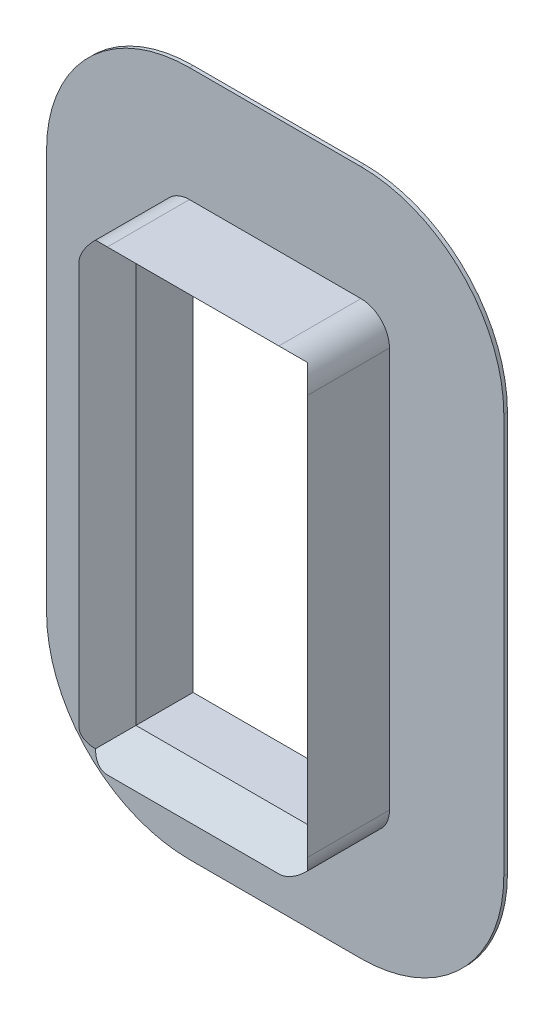
ISO-10303-21;
HEADER;
FILE_DESCRIPTION(('STEP AP214'),'2;1');
FILE_NAME('part.step','',(''),(''),'','','');
FILE_SCHEMA(('AUTOMOTIVE_DESIGN { 1 0 10303 214 1 1 1 1 }'));
ENDSEC;
DATA;
#1=APPLICATION_CONTEXT('core data for automotive mechanical design processes');
#2=APPLICATION_PROTOCOL_DEFINITION('international standard','automotive_design',2000,#1);
#3=PRODUCT_CONTEXT('',#1,'mechanical');
#4=PRODUCT('Part','Part','',(#3));
#5=PRODUCT_RELATED_PRODUCT_CATEGORY('part','',(#4));
#6=PRODUCT_DEFINITION_FORMATION('','',#4);
#7=PRODUCT_DEFINITION_CONTEXT('part definition',#1,'design');
#8=PRODUCT_DEFINITION('design','',#6,#7);
#9=PRODUCT_DEFINITION_SHAPE('','',#8);
#10=(LENGTH_UNIT() NAMED_UNIT(*) SI_UNIT(.MILLI.,.METRE.));
#11=(NAMED_UNIT(*) PLANE_ANGLE_UNIT() SI_UNIT($,.RADIAN.));
#12=(NAMED_UNIT(*) SI_UNIT($,.STERADIAN.) SOLID_ANGLE_UNIT());
#13=UNCERTAINTY_MEASURE_WITH_UNIT(LENGTH_MEASURE(1.E-05),#10,'distance_accuracy_value','');
#14=(GEOMETRIC_REPRESENTATION_CONTEXT(3) GLOBAL_UNCERTAINTY_ASSIGNED_CONTEXT((#13)) GLOBAL_UNIT_ASSIGNED_CONTEXT((#10,
#11,#12)) REPRESENTATION_CONTEXT('',''));
#15=CARTESIAN_POINT('',(0.,0.,0.));
#16=DIRECTION('',(0.,0.,1.));
#17=DIRECTION('',(1.,0.,0.));
#18=AXIS2_PLACEMENT_3D('',#15,#16,#17);
#19=CARTESIAN_POINT('',(0.,146.05,9.525));
#20=DIRECTION('',(0.,1.,0.));
#21=DIRECTION('',(0.,0.,1.));
#22=AXIS2_PLACEMENT_3D('',#19,#20,#21);
#23=PLANE('',#22);
#24=DIRECTION('',(1.,0.,0.));
#25=VECTOR('',#24,1.);
#26=CARTESIAN_POINT('',(0.,146.05,0.));
#27=LINE('',#26,#25);
#28=CARTESIAN_POINT('',(-9.52499999999998,146.05,0.));
#29=VERTEX_POINT('',#28);
#30=CARTESIAN_POINT('',(9.52499999999997,146.05,0.));
#31=VERTEX_POINT('',#30);
#32=EDGE_CURVE('E176',#29,#31,#27,.T.);
#33=ORIENTED_EDGE('',*,*,#32,.F.);
#34=DIRECTION('',(0.,0.,-1.));
#35=VECTOR('',#34,1.);
#36=CARTESIAN_POINT('',(-9.52499999999998,146.05,9.525));
#37=LINE('',#36,#35);
#38=CARTESIAN_POINT('',(-9.52499999999998,146.05,9.525));
#39=VERTEX_POINT('',#38);
#40=EDGE_CURVE('E161',#39,#29,#37,.T.);
#41=ORIENTED_EDGE('',*,*,#40,.F.);
#42=DIRECTION('',(1.,0.,0.));
#43=VECTOR('',#42,1.);
#44=CARTESIAN_POINT('',(0.,146.05,9.525));
#45=LINE('',#44,#43);
#46=CARTESIAN_POINT('',(9.52499999999997,146.05,9.525));
#47=VERTEX_POINT('',#46);
#48=EDGE_CURVE('E173',#39,#47,#45,.T.);
#49=ORIENTED_EDGE('',*,*,#48,.T.);
#50=DIRECTION('',(0.,0.,-1.));
#51=VECTOR('',#50,1.);
#52=CARTESIAN_POINT('',(9.52499999999997,146.05,9.525));
#53=LINE('',#52,#51);
#54=EDGE_CURVE('E244',#47,#31,#53,.T.);
#55=ORIENTED_EDGE('',*,*,#54,.T.);
#56=EDGE_LOOP('',(#33,#41,#49,#55));
#57=FACE_BOUND('',#56,.T.);
#58=ADVANCED_FACE('F56',(#57),#23,.T.);
#59=CARTESIAN_POINT('',(-9.52500000000001,142.875,9.525));
#60=DIRECTION('',(0.,0.,-1.));
#61=DIRECTION('',(-1.,0.,0.));
#62=AXIS2_PLACEMENT_3D('',#59,#60,#61);
#63=CYLINDRICAL_SURFACE('',#62,3.17500000000001);
#64=DIRECTION('',(0.,0.,-1.));
#65=VECTOR('',#64,1.);
#66=CARTESIAN_POINT('',(-12.7,142.875,9.525));
#67=LINE('',#66,#65);
#68=CARTESIAN_POINT('',(-12.7,142.875,9.525));
#69=VERTEX_POINT('',#68);
#70=CARTESIAN_POINT('',(-12.7,142.875,0.));
#71=VERTEX_POINT('',#70);
#72=EDGE_CURVE('E179',#69,#71,#67,.T.);
#73=ORIENTED_EDGE('',*,*,#72,.F.);
#74=CARTESIAN_POINT('',(-9.52500000000001,142.875,6.35));
#75=DIRECTION('',(-0.707106781186546,0.,-0.707106781186549));
#76=DIRECTION('',(0.707106781186549,0.,-0.707106781186546));
#77=AXIS2_PLACEMENT_3D('',#74,#75,#76);
#78=ELLIPSE('',#77,4.49012806053458,3.17500000000001);
#79=CARTESIAN_POINT('',(-11.7700640302673,145.120064030267,8.59506403026728));
#80=VERTEX_POINT('',#79);
#81=EDGE_CURVE('E67',#69,#80,#78,.T.);
#82=ORIENTED_EDGE('',*,*,#81,.T.);
#83=CARTESIAN_POINT('',(-9.52500000000001,142.875,6.35));
#84=DIRECTION('',(0.,-0.707106781186546,0.707106781186549));
#85=DIRECTION('',(0.,-0.707106781186549,-0.707106781186546));
#86=AXIS2_PLACEMENT_3D('',#83,#84,#85);
#87=ELLIPSE('',#86,4.49012806053458,3.17500000000001);
#88=EDGE_CURVE('E157',#80,#39,#87,.F.);
#89=ORIENTED_EDGE('',*,*,#88,.T.);
#90=ORIENTED_EDGE('',*,*,#40,.T.);
#91=CARTESIAN_POINT('',(-9.52500000000001,142.875,0.));
#92=DIRECTION('',(0.,0.,1.));
#93=DIRECTION('',(1.,0.,0.));
#94=AXIS2_PLACEMENT_3D('',#91,#92,#93);
#95=CIRCLE('',#94,3.17500000000001);
#96=EDGE_CURVE('E222',#29,#71,#95,.T.);
#97=ORIENTED_EDGE('',*,*,#96,.T.);
#98=EDGE_LOOP('',(#73,#82,#89,#90,#97));
#99=FACE_BOUND('',#98,.T.);
#100=ADVANCED_FACE('F159',(#99),#63,.T.);
#101=CARTESIAN_POINT('',(-12.7,0.,9.525));
#102=DIRECTION('',(1.,0.,0.));
#103=DIRECTION('',(0.,1.,0.));
#104=AXIS2_PLACEMENT_3D('',#101,#102,#103);
#105=PLANE('',#104);
#106=DIRECTION('',(0.,-1.,0.));
#107=VECTOR('',#106,1.);
#108=CARTESIAN_POINT('',(-12.7,0.,0.));
#109=LINE('',#108,#107);
#110=CARTESIAN_POINT('',(-12.7,98.425,0.));
#111=VERTEX_POINT('',#110);
#112=EDGE_CURVE('E225',#71,#111,#109,.T.);
#113=ORIENTED_EDGE('',*,*,#112,.T.);
#114=DIRECTION('',(0.,0.,-1.));
#115=VECTOR('',#114,1.);
#116=CARTESIAN_POINT('',(-12.7,98.425,9.525));
#117=LINE('',#116,#115);
#118=CARTESIAN_POINT('',(-12.7,98.425,9.525));
#119=VERTEX_POINT('',#118);
#120=EDGE_CURVE('E262',#119,#111,#117,.T.);
#121=ORIENTED_EDGE('',*,*,#120,.F.);
#122=DIRECTION('',(0.,-1.,0.));
#123=VECTOR('',#122,1.);
#124=CARTESIAN_POINT('',(-12.7,0.,9.525));
#125=LINE('',#124,#123);
#126=EDGE_CURVE('E184',#69,#119,#125,.T.);
#127=ORIENTED_EDGE('',*,*,#126,.F.);
#128=ORIENTED_EDGE('',*,*,#72,.T.);
#129=EDGE_LOOP('',(#113,#121,#127,#128));
#130=FACE_BOUND('',#129,.T.);
#131=ADVANCED_FACE('F336',(#130),#105,.F.);
#132=CARTESIAN_POINT('',(-9.525,98.425,9.525));
#133=DIRECTION('',(0.,0.,-1.));
#134=DIRECTION('',(-1.,0.,0.));
#135=AXIS2_PLACEMENT_3D('',#132,#133,#134);
#136=CYLINDRICAL_SURFACE('',#135,3.175);
#137=DIRECTION('',(0.,0.,-1.));
#138=VECTOR('',#137,1.);
#139=CARTESIAN_POINT('',(-9.52499999999998,95.25,9.525));
#140=LINE('',#139,#138);
#141=CARTESIAN_POINT('',(-9.52499999999998,95.25,9.525));
#142=VERTEX_POINT('',#141);
#143=CARTESIAN_POINT('',(-9.52499999999998,95.25,0.));
#144=VERTEX_POINT('',#143);
#145=EDGE_CURVE('E258',#142,#144,#140,.T.);
#146=ORIENTED_EDGE('',*,*,#145,.F.);
#147=CARTESIAN_POINT('',(-9.525,98.425,6.35000000000003));
#148=DIRECTION('',(0.,-0.707106781186546,-0.707106781186549));
#149=DIRECTION('',(0.,0.707106781186549,-0.707106781186546));
#150=AXIS2_PLACEMENT_3D('',#147,#148,#149);
#151=ELLIPSE('',#150,4.49012806053456,3.175);
#152=CARTESIAN_POINT('',(-11.7700640302673,96.1799359697327,8.5950640302673));
#153=VERTEX_POINT('',#152);
#154=EDGE_CURVE('E291',#142,#153,#151,.T.);
#155=ORIENTED_EDGE('',*,*,#154,.T.);
#156=CARTESIAN_POINT('',(-9.525,98.425,6.34999999999999));
#157=DIRECTION('',(-0.707106781186546,0.,-0.707106781186549));
#158=DIRECTION('',(0.707106781186549,0.,-0.707106781186546));
#159=AXIS2_PLACEMENT_3D('',#156,#157,#158);
#160=ELLIPSE('',#159,4.49012806053456,3.175);
#161=EDGE_CURVE('E288',#153,#119,#160,.T.);
#162=ORIENTED_EDGE('',*,*,#161,.T.);
#163=ORIENTED_EDGE('',*,*,#120,.T.);
#164=CARTESIAN_POINT('',(-9.525,98.425,0.));
#165=DIRECTION('',(0.,0.,1.));
#166=DIRECTION('',(1.,0.,0.));
#167=AXIS2_PLACEMENT_3D('',#164,#165,#166);
#168=CIRCLE('',#167,3.175);
#169=EDGE_CURVE('E229',#111,#144,#168,.T.);
#170=ORIENTED_EDGE('',*,*,#169,.T.);
#171=EDGE_LOOP('',(#146,#155,#162,#163,#170));
#172=FACE_BOUND('',#171,.T.);
#173=ADVANCED_FACE('F395',(#172),#136,.T.);
#174=CARTESIAN_POINT('',(0.,95.25,9.525));
#175=DIRECTION('',(0.,1.,0.));
#176=DIRECTION('',(0.,0.,1.));
#177=AXIS2_PLACEMENT_3D('',#174,#175,#176);
#178=PLANE('',#177);
#179=DIRECTION('',(1.,0.,0.));
#180=VECTOR('',#179,1.);
#181=CARTESIAN_POINT('',(0.,95.25,0.));
#182=LINE('',#181,#180);
#183=CARTESIAN_POINT('',(9.52499999999998,95.25,0.));
#184=VERTEX_POINT('',#183);
#185=EDGE_CURVE('E233',#144,#184,#182,.T.);
#186=ORIENTED_EDGE('',*,*,#185,.T.);
#187=DIRECTION('',(0.,0.,-1.));
#188=VECTOR('',#187,1.);
#189=CARTESIAN_POINT('',(9.52499999999998,95.25,9.525));
#190=LINE('',#189,#188);
#191=CARTESIAN_POINT('',(9.52499999999998,95.25,9.525));
#192=VERTEX_POINT('',#191);
#193=EDGE_CURVE('E254',#192,#184,#190,.T.);
#194=ORIENTED_EDGE('',*,*,#193,.F.);
#195=DIRECTION('',(1.,0.,0.));
#196=VECTOR('',#195,1.);
#197=CARTESIAN_POINT('',(0.,95.25,9.525));
#198=LINE('',#197,#196);
#199=EDGE_CURVE('E190',#142,#192,#198,.T.);
#200=ORIENTED_EDGE('',*,*,#199,.F.);
#201=ORIENTED_EDGE('',*,*,#145,.T.);
#202=EDGE_LOOP('',(#186,#194,#200,#201));
#203=FACE_BOUND('',#202,.T.);
#204=ADVANCED_FACE('F391',(#203),#178,.F.);
#205=CARTESIAN_POINT('',(9.52500000000001,98.425,9.525));
#206=DIRECTION('',(0.,0.,-1.));
#207=DIRECTION('',(-1.,0.,0.));
#208=AXIS2_PLACEMENT_3D('',#205,#206,#207);
#209=CYLINDRICAL_SURFACE('',#208,3.175);
#210=CARTESIAN_POINT('',(9.52500000000001,98.425,6.35000000000003));
#211=DIRECTION('',(-0.707106781186546,0.,0.707106781186549));
#212=DIRECTION('',(-0.707106781186549,0.,-0.707106781186546));
#213=AXIS2_PLACEMENT_3D('',#210,#211,#212);
#214=ELLIPSE('',#213,4.49012806053457,3.175);
#215=CARTESIAN_POINT('',(12.7,98.425,9.525));
#216=VERTEX_POINT('',#215);
#217=CARTESIAN_POINT('',(11.7700640302673,96.1799359697327,8.59506403026728));
#218=VERTEX_POINT('',#217);
#219=EDGE_CURVE('E282',#216,#218,#214,.F.);
#220=ORIENTED_EDGE('',*,*,#219,.T.);
#221=CARTESIAN_POINT('',(9.52500000000001,98.425,6.35));
#222=DIRECTION('',(0.,-0.707106781186546,-0.707106781186549));
#223=DIRECTION('',(0.,0.707106781186549,-0.707106781186546));
#224=AXIS2_PLACEMENT_3D('',#221,#222,#223);
#225=ELLIPSE('',#224,4.49012806053457,3.175);
#226=EDGE_CURVE('E285',#218,#192,#225,.T.);
#227=ORIENTED_EDGE('',*,*,#226,.T.);
#228=ORIENTED_EDGE('',*,*,#193,.T.);
#229=CARTESIAN_POINT('',(9.52500000000001,98.425,0.));
#230=DIRECTION('',(0.,0.,1.));
#231=DIRECTION('',(1.,0.,0.));
#232=AXIS2_PLACEMENT_3D('',#229,#230,#231);
#233=CIRCLE('',#232,3.175);
#234=CARTESIAN_POINT('',(12.7,98.425,0.));
#235=VERTEX_POINT('',#234);
#236=EDGE_CURVE('E237',#184,#235,#233,.T.);
#237=ORIENTED_EDGE('',*,*,#236,.T.);
#238=DIRECTION('',(0.,0.,-1.));
#239=VECTOR('',#238,1.);
#240=CARTESIAN_POINT('',(12.7,98.425,9.525));
#241=LINE('',#240,#239);
#242=EDGE_CURVE('E251',#216,#235,#241,.T.);
#243=ORIENTED_EDGE('',*,*,#242,.F.);
#244=EDGE_LOOP('',(#220,#227,#228,#237,#243));
#245=FACE_BOUND('',#244,.T.);
#246=ADVANCED_FACE('F388',(#245),#209,.T.);
#247=CARTESIAN_POINT('',(12.7,0.,9.525));
#248=DIRECTION('',(1.,0.,0.));
#249=DIRECTION('',(0.,1.,0.));
#250=AXIS2_PLACEMENT_3D('',#247,#248,#249);
#251=PLANE('',#250);
#252=DIRECTION('',(0.,-1.,0.));
#253=VECTOR('',#252,1.);
#254=CARTESIAN_POINT('',(12.7,0.,0.));
#255=LINE('',#254,#253);
#256=CARTESIAN_POINT('',(12.7,142.875,0.));
#257=VERTEX_POINT('',#256);
#258=EDGE_CURVE('E193',#257,#235,#255,.T.);
#259=ORIENTED_EDGE('',*,*,#258,.F.);
#260=DIRECTION('',(0.,0.,-1.));
#261=VECTOR('',#260,1.);
#262=CARTESIAN_POINT('',(12.7,142.875,9.525));
#263=LINE('',#262,#261);
#264=CARTESIAN_POINT('',(12.7,142.875,9.525));
#265=VERTEX_POINT('',#264);
#266=EDGE_CURVE('E247',#265,#257,#263,.T.);
#267=ORIENTED_EDGE('',*,*,#266,.F.);
#268=DIRECTION('',(0.,-1.,0.));
#269=VECTOR('',#268,1.);
#270=CARTESIAN_POINT('',(12.7,0.,9.525));
#271=LINE('',#270,#269);
#272=EDGE_CURVE('E199',#265,#216,#271,.T.);
#273=ORIENTED_EDGE('',*,*,#272,.T.);
#274=ORIENTED_EDGE('',*,*,#242,.T.);
#275=EDGE_LOOP('',(#259,#267,#273,#274));
#276=FACE_BOUND('',#275,.T.);
#277=ADVANCED_FACE('F332',(#276),#251,.T.);
#278=CARTESIAN_POINT('',(-9.52500000000001,0.,9.525));
#279=DIRECTION('',(1.,0.,0.));
#280=DIRECTION('',(0.,0.,-1.));
#281=AXIS2_PLACEMENT_3D('',#278,#279,#280);
#282=PLANE('',#281);
#283=DIRECTION('',(0.,0.,-1.));
#284=VECTOR('',#283,1.);
#285=CARTESIAN_POINT('',(-9.52500000000001,142.875,9.525));
#286=LINE('',#285,#284);
#287=CARTESIAN_POINT('',(-9.52500000000001,142.875,6.35));
#288=VERTEX_POINT('',#287);
#289=CARTESIAN_POINT('',(-9.52500000000001,142.875,0.));
#290=VERTEX_POINT('',#289);
#291=EDGE_CURVE('E248',#288,#290,#286,.T.);
#292=ORIENTED_EDGE('',*,*,#291,.F.);
#293=DIRECTION('',(0.,-1.,0.));
#294=VECTOR('',#293,1.);
#295=CARTESIAN_POINT('',(-9.52500000000001,0.,6.35));
#296=LINE('',#295,#294);
#297=CARTESIAN_POINT('',(-9.52500000000001,98.425,6.35));
#298=VERTEX_POINT('',#297);
#299=EDGE_CURVE('E168',#288,#298,#296,.T.);
#300=ORIENTED_EDGE('',*,*,#299,.T.);
#301=DIRECTION('',(0.,0.,-1.));
#302=VECTOR('',#301,1.);
#303=CARTESIAN_POINT('',(-9.52500000000001,98.425,9.525));
#304=LINE('',#303,#302);
#305=CARTESIAN_POINT('',(-9.52500000000001,98.425,0.));
#306=VERTEX_POINT('',#305);
#307=EDGE_CURVE('E203',#298,#306,#304,.T.);
#308=ORIENTED_EDGE('',*,*,#307,.T.);
#309=DIRECTION('',(0.,-1.,0.));
#310=VECTOR('',#309,1.);
#311=CARTESIAN_POINT('',(-9.52500000000001,0.,0.));
#312=LINE('',#311,#310);
#313=EDGE_CURVE('E204',#290,#306,#312,.T.);
#314=ORIENTED_EDGE('',*,*,#313,.F.);
#315=EDGE_LOOP('',(#292,#300,#308,#314));
#316=FACE_BOUND('',#315,.T.);
#317=ADVANCED_FACE('F358',(#316),#282,.T.);
#318=CARTESIAN_POINT('',(0.,142.875,9.525));
#319=DIRECTION('',(0.,1.,0.));
#320=DIRECTION('',(0.,0.,1.));
#321=AXIS2_PLACEMENT_3D('',#318,#319,#320);
#322=PLANE('',#321);
#323=DIRECTION('',(0.,0.,-1.));
#324=VECTOR('',#323,1.);
#325=CARTESIAN_POINT('',(9.525,142.875,9.525));
#326=LINE('',#325,#324);
#327=CARTESIAN_POINT('',(9.525,142.875,6.35));
#328=VERTEX_POINT('',#327);
#329=CARTESIAN_POINT('',(9.525,142.875,0.));
#330=VERTEX_POINT('',#329);
#331=EDGE_CURVE('E274',#328,#330,#326,.T.);
#332=ORIENTED_EDGE('',*,*,#331,.F.);
#333=DIRECTION('',(-1.,0.,0.));
#334=VECTOR('',#333,1.);
#335=CARTESIAN_POINT('',(-9.52500000000001,142.875,6.35));
#336=LINE('',#335,#334);
#337=EDGE_CURVE('E12',#328,#288,#336,.T.);
#338=ORIENTED_EDGE('',*,*,#337,.T.);
#339=ORIENTED_EDGE('',*,*,#291,.T.);
#340=DIRECTION('',(1.,0.,0.));
#341=VECTOR('',#340,1.);
#342=CARTESIAN_POINT('',(0.,142.875,0.));
#343=LINE('',#342,#341);
#344=EDGE_CURVE('E208',#290,#330,#343,.T.);
#345=ORIENTED_EDGE('',*,*,#344,.T.);
#346=EDGE_LOOP('',(#332,#338,#339,#345));
#347=FACE_BOUND('',#346,.T.);
#348=ADVANCED_FACE('F359',(#347),#322,.F.);
#349=CARTESIAN_POINT('',(9.52499999999995,0.,9.525));
#350=DIRECTION('',(1.,0.,0.));
#351=DIRECTION('',(0.,1.,0.));
#352=AXIS2_PLACEMENT_3D('',#349,#350,#351);
#353=PLANE('',#352);
#354=DIRECTION('',(0.,0.,-1.));
#355=VECTOR('',#354,1.);
#356=CARTESIAN_POINT('',(9.52499999999998,98.425,9.525));
#357=LINE('',#356,#355);
#358=CARTESIAN_POINT('',(9.52499999999998,98.425,6.35));
#359=VERTEX_POINT('',#358);
#360=CARTESIAN_POINT('',(9.52499999999998,98.425,0.));
#361=VERTEX_POINT('',#360);
#362=EDGE_CURVE('E271',#359,#361,#357,.T.);
#363=ORIENTED_EDGE('',*,*,#362,.F.);
#364=DIRECTION('',(0.,1.,0.));
#365=VECTOR('',#364,1.);
#366=CARTESIAN_POINT('',(9.525,142.875,6.35));
#367=LINE('',#366,#365);
#368=EDGE_CURVE('E294',#359,#328,#367,.T.);
#369=ORIENTED_EDGE('',*,*,#368,.T.);
#370=ORIENTED_EDGE('',*,*,#331,.T.);
#371=DIRECTION('',(0.,-1.,0.));
#372=VECTOR('',#371,1.);
#373=CARTESIAN_POINT('',(9.52499999999995,0.,0.));
#374=LINE('',#373,#372);
#375=EDGE_CURVE('E212',#330,#361,#374,.T.);
#376=ORIENTED_EDGE('',*,*,#375,.T.);
#377=EDGE_LOOP('',(#363,#369,#370,#376));
#378=FACE_BOUND('',#377,.T.);
#379=ADVANCED_FACE('F352',(#378),#353,.F.);
#380=CARTESIAN_POINT('',(1.43403807347416E-13,98.425,9.525));
#381=DIRECTION('',(0.,1.,0.));
#382=DIRECTION('',(-1.,0.,0.));
#383=AXIS2_PLACEMENT_3D('',#380,#381,#382);
#384=PLANE('',#383);
#385=ORIENTED_EDGE('',*,*,#307,.F.);
#386=DIRECTION('',(1.,0.,0.));
#387=VECTOR('',#386,1.);
#388=CARTESIAN_POINT('',(1.43403807347416E-13,98.425,6.35));
#389=LINE('',#388,#387);
#390=EDGE_CURVE('E178',#298,#359,#389,.T.);
#391=ORIENTED_EDGE('',*,*,#390,.T.);
#392=ORIENTED_EDGE('',*,*,#362,.T.);
#393=DIRECTION('',(1.,0.,0.));
#394=VECTOR('',#393,1.);
#395=CARTESIAN_POINT('',(1.43403807347416E-13,98.425,0.));
#396=LINE('',#395,#394);
#397=EDGE_CURVE('E216',#306,#361,#396,.T.);
#398=ORIENTED_EDGE('',*,*,#397,.F.);
#399=EDGE_LOOP('',(#385,#391,#392,#398));
#400=FACE_BOUND('',#399,.T.);
#401=ADVANCED_FACE('F349',(#400),#384,.T.);
#402=CARTESIAN_POINT('',(9.52499999999999,142.875,9.525));
#403=DIRECTION('',(0.,0.,-1.));
#404=DIRECTION('',(-1.,0.,0.));
#405=AXIS2_PLACEMENT_3D('',#402,#403,#404);
#406=CYLINDRICAL_SURFACE('',#405,3.17500000000001);
#407=CARTESIAN_POINT('',(9.52499999999999,142.875,6.35));
#408=DIRECTION('',(0.,-0.707106781186546,0.707106781186549));
#409=DIRECTION('',(0.,-0.707106781186549,-0.707106781186546));
#410=AXIS2_PLACEMENT_3D('',#407,#408,#409);
#411=ELLIPSE('',#410,4.49012806053458,3.17500000000001);
#412=CARTESIAN_POINT('',(11.7700640302673,145.120064030267,8.59506403026729));
#413=VERTEX_POINT('',#412);
#414=EDGE_CURVE('E182',#47,#413,#411,.F.);
#415=ORIENTED_EDGE('',*,*,#414,.T.);
#416=CARTESIAN_POINT('',(9.52499999999999,142.875,6.35));
#417=DIRECTION('',(-0.707106781186546,0.,0.707106781186549));
#418=DIRECTION('',(-0.707106781186549,0.,-0.707106781186546));
#419=AXIS2_PLACEMENT_3D('',#416,#417,#418);
#420=ELLIPSE('',#419,4.49012806053458,3.17500000000001);
#421=EDGE_CURVE('E299',#413,#265,#420,.F.);
#422=ORIENTED_EDGE('',*,*,#421,.T.);
#423=ORIENTED_EDGE('',*,*,#266,.T.);
#424=CARTESIAN_POINT('',(9.52499999999999,142.875,0.));
#425=DIRECTION('',(0.,0.,1.));
#426=DIRECTION('',(1.,0.,0.));
#427=AXIS2_PLACEMENT_3D('',#424,#425,#426);
#428=CIRCLE('',#427,3.17500000000001);
#429=EDGE_CURVE('E185',#257,#31,#428,.T.);
#430=ORIENTED_EDGE('',*,*,#429,.T.);
#431=ORIENTED_EDGE('',*,*,#54,.F.);
#432=EDGE_LOOP('',(#415,#422,#423,#430,#431));
#433=FACE_BOUND('',#432,.T.);
#434=ADVANCED_FACE('F328',(#433),#406,.T.);
#435=CARTESIAN_POINT('',(0.,0.,0.));
#436=DIRECTION('',(0.,0.,1.));
#437=DIRECTION('',(1.,0.,0.));
#438=AXIS2_PLACEMENT_3D('',#435,#436,#437);
#439=PLANE('',#438);
#440=ORIENTED_EDGE('',*,*,#313,.T.);
#441=ORIENTED_EDGE('',*,*,#397,.T.);
#442=ORIENTED_EDGE('',*,*,#375,.F.);
#443=ORIENTED_EDGE('',*,*,#344,.F.);
#444=EDGE_LOOP('',(#440,#441,#442,#443));
#445=FACE_BOUND('',#444,.T.);
#446=ORIENTED_EDGE('',*,*,#32,.T.);
#447=ORIENTED_EDGE('',*,*,#429,.F.);
#448=ORIENTED_EDGE('',*,*,#258,.T.);
#449=ORIENTED_EDGE('',*,*,#236,.F.);
#450=ORIENTED_EDGE('',*,*,#185,.F.);
#451=ORIENTED_EDGE('',*,*,#169,.F.);
#452=ORIENTED_EDGE('',*,*,#112,.F.);
#453=ORIENTED_EDGE('',*,*,#96,.F.);
#454=EDGE_LOOP('',(#446,#447,#448,#449,#450,#451,#452,#453));
#455=FACE_BOUND('',#454,.T.);
#456=ADVANCED_FACE('F334',(#445,#455),#439,.F.);
#457=CARTESIAN_POINT('',(0.,146.05,9.525));
#458=DIRECTION('',(0.,-0.707106781186546,0.707106781186549));
#459=DIRECTION('',(-1.,0.,0.));
#460=AXIS2_PLACEMENT_3D('',#457,#458,#459);
#461=PLANE('',#460);
#462=ORIENTED_EDGE('',*,*,#48,.F.);
#463=ORIENTED_EDGE('',*,*,#88,.F.);
#464=DIRECTION('',(0.577350269189627,-0.577350269189627,-0.577350269189624));
#465=VECTOR('',#464,1.);
#466=CARTESIAN_POINT('',(-8.46666666666667,141.816666666667,5.29166666666666));
#467=LINE('',#466,#465);
#468=EDGE_CURVE('E61',#288,#80,#467,.F.);
#469=ORIENTED_EDGE('',*,*,#468,.F.);
#470=ORIENTED_EDGE('',*,*,#337,.F.);
#471=DIRECTION('',(-0.577350269189627,-0.577350269189627,-0.577350269189624));
#472=VECTOR('',#471,1.);
#473=CARTESIAN_POINT('',(8.46666666666666,141.816666666667,5.29166666666667));
#474=LINE('',#473,#472);
#475=EDGE_CURVE('E312',#413,#328,#474,.T.);
#476=ORIENTED_EDGE('',*,*,#475,.F.);
#477=ORIENTED_EDGE('',*,*,#414,.F.);
#478=EDGE_LOOP('',(#462,#463,#469,#470,#476,#477));
#479=FACE_BOUND('',#478,.T.);
#480=ADVANCED_FACE('F59',(#479),#461,.T.);
#481=CARTESIAN_POINT('',(-9.52500000000001,0.,6.35));
#482=DIRECTION('',(-0.707106781186546,0.,-0.707106781186549));
#483=DIRECTION('',(0.,-1.,0.));
#484=AXIS2_PLACEMENT_3D('',#481,#482,#483);
#485=PLANE('',#484);
#486=ORIENTED_EDGE('',*,*,#126,.T.);
#487=ORIENTED_EDGE('',*,*,#161,.F.);
#488=DIRECTION('',(-0.577350269189627,-0.577350269189626,0.577350269189624));
#489=VECTOR('',#488,1.);
#490=CARTESIAN_POINT('',(-42.3333333333334,65.6166666666666,39.1583333333333));
#491=LINE('',#490,#489);
#492=EDGE_CURVE('E309',#298,#153,#491,.T.);
#493=ORIENTED_EDGE('',*,*,#492,.F.);
#494=ORIENTED_EDGE('',*,*,#299,.F.);
#495=ORIENTED_EDGE('',*,*,#468,.T.);
#496=ORIENTED_EDGE('',*,*,#81,.F.);
#497=EDGE_LOOP('',(#486,#487,#493,#494,#495,#496));
#498=FACE_BOUND('',#497,.T.);
#499=ADVANCED_FACE('F321',(#498),#485,.F.);
#500=CARTESIAN_POINT('',(12.7,0.,9.525));
#501=DIRECTION('',(-0.707106781186546,0.,0.707106781186549));
#502=DIRECTION('',(0.,1.,0.));
#503=AXIS2_PLACEMENT_3D('',#500,#501,#502);
#504=PLANE('',#503);
#505=ORIENTED_EDGE('',*,*,#475,.T.);
#506=ORIENTED_EDGE('',*,*,#368,.F.);
#507=DIRECTION('',(0.577350269189626,-0.577350269189627,0.577350269189624));
#508=VECTOR('',#507,1.);
#509=CARTESIAN_POINT('',(44.4500000000001,63.4999999999998,41.275));
#510=LINE('',#509,#508);
#511=EDGE_CURVE('E306',#218,#359,#510,.F.);
#512=ORIENTED_EDGE('',*,*,#511,.F.);
#513=ORIENTED_EDGE('',*,*,#219,.F.);
#514=ORIENTED_EDGE('',*,*,#272,.F.);
#515=ORIENTED_EDGE('',*,*,#421,.F.);
#516=EDGE_LOOP('',(#505,#506,#512,#513,#514,#515));
#517=FACE_BOUND('',#516,.T.);
#518=ADVANCED_FACE('F324',(#517),#504,.T.);
#519=CARTESIAN_POINT('',(1.43403807347416E-13,98.425,6.35));
#520=DIRECTION('',(0.,-0.707106781186546,-0.707106781186549));
#521=DIRECTION('',(1.,0.,0.));
#522=AXIS2_PLACEMENT_3D('',#519,#520,#521);
#523=PLANE('',#522);
#524=ORIENTED_EDGE('',*,*,#154,.F.);
#525=ORIENTED_EDGE('',*,*,#199,.T.);
#526=ORIENTED_EDGE('',*,*,#226,.F.);
#527=ORIENTED_EDGE('',*,*,#511,.T.);
#528=ORIENTED_EDGE('',*,*,#390,.F.);
#529=ORIENTED_EDGE('',*,*,#492,.T.);
#530=EDGE_LOOP('',(#524,#525,#526,#527,#528,#529));
#531=FACE_BOUND('',#530,.T.);
#532=ADVANCED_FACE('F342',(#531),#523,.F.);
#533=CLOSED_SHELL('',(#58,#100,#131,#173,#204,#246,#277,#317,#348,#379,#401,#434,#456,#480,#499,
#518,#532));
#534=MANIFOLD_SOLID_BREP('B2',#533);
#535=CARTESIAN_POINT('',(-9.52500000000001,142.875,0.4064));
#536=DIRECTION('',(0.,0.,-1.));
#537=DIRECTION('',(-1.,0.,0.));
#538=AXIS2_PLACEMENT_3D('',#535,#536,#537);
#539=PLANE('',#538);
#540=CARTESIAN_POINT('',(-9.52500000000001,142.875,0.4064));
#541=DIRECTION('',(0.,0.,1.));
#542=DIRECTION('',(-1.,0.,0.));
#543=AXIS2_PLACEMENT_3D('',#540,#541,#542);
#544=CIRCLE('',#543,15.875);
#545=CARTESIAN_POINT('',(-9.52499999999989,158.75,0.4064));
#546=VERTEX_POINT('',#545);
#547=CARTESIAN_POINT('',(-25.4,142.875,0.4064));
#548=VERTEX_POINT('',#547);
#549=EDGE_CURVE('E726',#546,#548,#544,.T.);
#550=ORIENTED_EDGE('',*,*,#549,.T.);
#551=DIRECTION('',(0.,-1.,0.));
#552=VECTOR('',#551,1.);
#553=CARTESIAN_POINT('',(-25.4,142.875,0.4064));
#554=LINE('',#553,#552);
#555=CARTESIAN_POINT('',(-25.4,98.4250000000001,0.4064));
#556=VERTEX_POINT('',#555);
#557=EDGE_CURVE('E729',#548,#556,#554,.T.);
#558=ORIENTED_EDGE('',*,*,#557,.T.);
#559=CARTESIAN_POINT('',(-9.525,98.425,0.4064));
#560=DIRECTION('',(0.,0.,1.));
#561=DIRECTION('',(1.,0.,0.));
#562=AXIS2_PLACEMENT_3D('',#559,#560,#561);
#563=CIRCLE('',#562,15.875);
#564=CARTESIAN_POINT('',(-9.52499999999998,82.55,0.4064));
#565=VERTEX_POINT('',#564);
#566=EDGE_CURVE('E732',#556,#565,#563,.T.);
#567=ORIENTED_EDGE('',*,*,#566,.T.);
#568=DIRECTION('',(1.,0.,0.));
#569=VECTOR('',#568,1.);
#570=CARTESIAN_POINT('',(-9.52499999999998,82.55,0.4064));
#571=LINE('',#570,#569);
#572=CARTESIAN_POINT('',(9.52499999999989,82.55,0.4064));
#573=VERTEX_POINT('',#572);
#574=EDGE_CURVE('E734',#565,#573,#571,.T.);
#575=ORIENTED_EDGE('',*,*,#574,.T.);
#576=CARTESIAN_POINT('',(9.52500000000001,98.425,0.4064));
#577=DIRECTION('',(0.,0.,1.));
#578=DIRECTION('',(-1.,0.,0.));
#579=AXIS2_PLACEMENT_3D('',#576,#577,#578);
#580=CIRCLE('',#579,15.875);
#581=CARTESIAN_POINT('',(25.4,98.425,0.4064));
#582=VERTEX_POINT('',#581);
#583=EDGE_CURVE('E736',#573,#582,#580,.T.);
#584=ORIENTED_EDGE('',*,*,#583,.T.);
#585=DIRECTION('',(0.,1.,0.));
#586=VECTOR('',#585,1.);
#587=CARTESIAN_POINT('',(25.4,142.875,0.4064));
#588=LINE('',#587,#586);
#589=CARTESIAN_POINT('',(25.4,142.875,0.4064));
#590=VERTEX_POINT('',#589);
#591=EDGE_CURVE('E738',#582,#590,#588,.T.);
#592=ORIENTED_EDGE('',*,*,#591,.T.);
#593=CARTESIAN_POINT('',(9.52499999999999,142.875,0.4064));
#594=DIRECTION('',(0.,0.,1.));
#595=DIRECTION('',(-1.,0.,0.));
#596=AXIS2_PLACEMENT_3D('',#593,#594,#595);
#597=CIRCLE('',#596,15.875);
#598=CARTESIAN_POINT('',(9.52499999999997,158.75,0.4064));
#599=VERTEX_POINT('',#598);
#600=EDGE_CURVE('E740',#590,#599,#597,.T.);
#601=ORIENTED_EDGE('',*,*,#600,.T.);
#602=DIRECTION('',(-1.,0.,0.));
#603=VECTOR('',#602,1.);
#604=CARTESIAN_POINT('',(-9.52499999999989,158.75,0.4064));
#605=LINE('',#604,#603);
#606=EDGE_CURVE('E742',#599,#546,#605,.T.);
#607=ORIENTED_EDGE('',*,*,#606,.T.);
#608=EDGE_LOOP('',(#550,#558,#567,#575,#584,#592,#601,#607));
#609=FACE_BOUND('',#608,.T.);
#610=CARTESIAN_POINT('',(9.52499999999999,142.875,0.4064));
#611=DIRECTION('',(0.,0.,1.));
#612=DIRECTION('',(-1.,0.,0.));
#613=AXIS2_PLACEMENT_3D('',#610,#611,#612);
#614=CIRCLE('',#613,3.17500000000001);
#615=CARTESIAN_POINT('',(12.7,142.875,0.4064));
#616=VERTEX_POINT('',#615);
#617=CARTESIAN_POINT('',(9.52499999999997,146.05,0.4064));
#618=VERTEX_POINT('',#617);
#619=EDGE_CURVE('E661',#616,#618,#614,.T.);
#620=ORIENTED_EDGE('',*,*,#619,.F.);
#621=DIRECTION('',(0.,1.,0.));
#622=VECTOR('',#621,1.);
#623=CARTESIAN_POINT('',(12.7,142.875,0.4064));
#624=LINE('',#623,#622);
#625=CARTESIAN_POINT('',(12.7,98.425,0.4064));
#626=VERTEX_POINT('',#625);
#627=EDGE_CURVE('E694',#626,#616,#624,.T.);
#628=ORIENTED_EDGE('',*,*,#627,.F.);
#629=CARTESIAN_POINT('',(9.52500000000001,98.425,0.4064));
#630=DIRECTION('',(0.,0.,1.));
#631=DIRECTION('',(-1.,0.,0.));
#632=AXIS2_PLACEMENT_3D('',#629,#630,#631);
#633=CIRCLE('',#632,3.175);
#634=CARTESIAN_POINT('',(9.52499999999998,95.25,0.4064));
#635=VERTEX_POINT('',#634);
#636=EDGE_CURVE('E692',#635,#626,#633,.T.);
#637=ORIENTED_EDGE('',*,*,#636,.F.);
#638=DIRECTION('',(1.,0.,0.));
#639=VECTOR('',#638,1.);
#640=CARTESIAN_POINT('',(-9.52499999999998,95.25,0.4064));
#641=LINE('',#640,#639);
#642=CARTESIAN_POINT('',(-9.52499999999998,95.25,0.4064));
#643=VERTEX_POINT('',#642);
#644=EDGE_CURVE('E690',#643,#635,#641,.T.);
#645=ORIENTED_EDGE('',*,*,#644,.F.);
#646=CARTESIAN_POINT('',(-9.525,98.425,0.4064));
#647=DIRECTION('',(0.,0.,1.));
#648=DIRECTION('',(1.,0.,0.));
#649=AXIS2_PLACEMENT_3D('',#646,#647,#648);
#650=CIRCLE('',#649,3.175);
#651=CARTESIAN_POINT('',(-12.7,98.425,0.4064));
#652=VERTEX_POINT('',#651);
#653=EDGE_CURVE('E688',#652,#643,#650,.T.);
#654=ORIENTED_EDGE('',*,*,#653,.F.);
#655=DIRECTION('',(0.,-1.,0.));
#656=VECTOR('',#655,1.);
#657=CARTESIAN_POINT('',(-12.7,142.875,0.4064));
#658=LINE('',#657,#656);
#659=CARTESIAN_POINT('',(-12.7,142.875,0.4064));
#660=VERTEX_POINT('',#659);
#661=EDGE_CURVE('E684',#660,#652,#658,.T.);
#662=ORIENTED_EDGE('',*,*,#661,.F.);
#663=CARTESIAN_POINT('',(-9.52500000000001,142.875,0.4064));
#664=DIRECTION('',(0.,0.,1.));
#665=DIRECTION('',(-1.,0.,0.));
#666=AXIS2_PLACEMENT_3D('',#663,#664,#665);
#667=CIRCLE('',#666,3.17500000000001);
#668=CARTESIAN_POINT('',(-9.52499999999998,146.05,0.4064));
#669=VERTEX_POINT('',#668);
#670=EDGE_CURVE('E682',#669,#660,#667,.T.);
#671=ORIENTED_EDGE('',*,*,#670,.F.);
#672=DIRECTION('',(-1.,0.,0.));
#673=VECTOR('',#672,1.);
#674=CARTESIAN_POINT('',(-9.52499999999998,146.05,0.4064));
#675=LINE('',#674,#673);
#676=EDGE_CURVE('E669',#618,#669,#675,.T.);
#677=ORIENTED_EDGE('',*,*,#676,.F.);
#678=EDGE_LOOP('',(#620,#628,#637,#645,#654,#662,#671,#677));
#679=FACE_BOUND('',#678,.T.);
#680=ADVANCED_FACE('F548',(#609,#679),#539,.F.);
#681=CARTESIAN_POINT('',(-9.52500000000001,142.875,0.));
#682=DIRECTION('',(0.,0.,-1.));
#683=DIRECTION('',(-1.,0.,0.));
#684=AXIS2_PLACEMENT_3D('',#681,#682,#683);
#685=PLANE('',#684);
#686=CARTESIAN_POINT('',(-9.52500000000001,142.875,0.));
#687=DIRECTION('',(0.,0.,1.));
#688=DIRECTION('',(-1.,0.,0.));
#689=AXIS2_PLACEMENT_3D('',#686,#687,#688);
#690=CIRCLE('',#689,15.875);
#691=CARTESIAN_POINT('',(-9.52499999999989,158.75,0.));
#692=VERTEX_POINT('',#691);
#693=CARTESIAN_POINT('',(-25.4,142.875,0.));
#694=VERTEX_POINT('',#693);
#695=EDGE_CURVE('E677',#692,#694,#690,.T.);
#696=ORIENTED_EDGE('',*,*,#695,.F.);
#697=DIRECTION('',(-1.,0.,0.));
#698=VECTOR('',#697,1.);
#699=CARTESIAN_POINT('',(-9.52499999999989,158.75,0.));
#700=LINE('',#699,#698);
#701=CARTESIAN_POINT('',(9.52499999999997,158.75,0.));
#702=VERTEX_POINT('',#701);
#703=EDGE_CURVE('E730',#702,#692,#700,.T.);
#704=ORIENTED_EDGE('',*,*,#703,.F.);
#705=CARTESIAN_POINT('',(9.52499999999999,142.875,0.));
#706=DIRECTION('',(0.,0.,1.));
#707=DIRECTION('',(-1.,0.,0.));
#708=AXIS2_PLACEMENT_3D('',#705,#706,#707);
#709=CIRCLE('',#708,15.875);
#710=CARTESIAN_POINT('',(25.4,142.875,0.));
#711=VERTEX_POINT('',#710);
#712=EDGE_CURVE('E757',#711,#702,#709,.T.);
#713=ORIENTED_EDGE('',*,*,#712,.F.);
#714=DIRECTION('',(0.,1.,0.));
#715=VECTOR('',#714,1.);
#716=CARTESIAN_POINT('',(25.4,142.875,0.));
#717=LINE('',#716,#715);
#718=CARTESIAN_POINT('',(25.4,98.425,0.));
#719=VERTEX_POINT('',#718);
#720=EDGE_CURVE('E755',#719,#711,#717,.T.);
#721=ORIENTED_EDGE('',*,*,#720,.F.);
#722=CARTESIAN_POINT('',(9.52500000000001,98.425,0.));
#723=DIRECTION('',(0.,0.,1.));
#724=DIRECTION('',(-1.,0.,0.));
#725=AXIS2_PLACEMENT_3D('',#722,#723,#724);
#726=CIRCLE('',#725,15.875);
#727=CARTESIAN_POINT('',(9.52499999999989,82.55,0.));
#728=VERTEX_POINT('',#727);
#729=EDGE_CURVE('E753',#728,#719,#726,.T.);
#730=ORIENTED_EDGE('',*,*,#729,.F.);
#731=DIRECTION('',(1.,0.,0.));
#732=VECTOR('',#731,1.);
#733=CARTESIAN_POINT('',(-9.52499999999998,82.55,0.));
#734=LINE('',#733,#732);
#735=CARTESIAN_POINT('',(-9.52499999999998,82.55,0.));
#736=VERTEX_POINT('',#735);
#737=EDGE_CURVE('E751',#736,#728,#734,.T.);
#738=ORIENTED_EDGE('',*,*,#737,.F.);
#739=CARTESIAN_POINT('',(-9.525,98.425,0.));
#740=DIRECTION('',(0.,0.,1.));
#741=DIRECTION('',(1.,0.,0.));
#742=AXIS2_PLACEMENT_3D('',#739,#740,#741);
#743=CIRCLE('',#742,15.875);
#744=CARTESIAN_POINT('',(-25.4,98.4250000000001,0.));
#745=VERTEX_POINT('',#744);
#746=EDGE_CURVE('E749',#745,#736,#743,.T.);
#747=ORIENTED_EDGE('',*,*,#746,.F.);
#748=DIRECTION('',(0.,-1.,0.));
#749=VECTOR('',#748,1.);
#750=CARTESIAN_POINT('',(-25.4,142.875,0.));
#751=LINE('',#750,#749);
#752=EDGE_CURVE('E747',#694,#745,#751,.T.);
#753=ORIENTED_EDGE('',*,*,#752,.F.);
#754=EDGE_LOOP('',(#696,#704,#713,#721,#730,#738,#747,#753));
#755=FACE_BOUND('',#754,.T.);
#756=DIRECTION('',(0.,1.,0.));
#757=VECTOR('',#756,1.);
#758=CARTESIAN_POINT('',(12.7,142.875,0.));
#759=LINE('',#758,#757);
#760=CARTESIAN_POINT('',(12.7,98.425,0.));
#761=VERTEX_POINT('',#760);
#762=CARTESIAN_POINT('',(12.7,142.875,0.));
#763=VERTEX_POINT('',#762);
#764=EDGE_CURVE('E670',#761,#763,#759,.T.);
#765=ORIENTED_EDGE('',*,*,#764,.T.);
#766=CARTESIAN_POINT('',(9.52499999999999,142.875,0.));
#767=DIRECTION('',(0.,0.,1.));
#768=DIRECTION('',(-1.,0.,0.));
#769=AXIS2_PLACEMENT_3D('',#766,#767,#768);
#770=CIRCLE('',#769,3.17500000000001);
#771=CARTESIAN_POINT('',(9.52499999999997,146.05,0.));
#772=VERTEX_POINT('',#771);
#773=EDGE_CURVE('E571',#763,#772,#770,.T.);
#774=ORIENTED_EDGE('',*,*,#773,.T.);
#775=DIRECTION('',(-1.,0.,0.));
#776=VECTOR('',#775,1.);
#777=CARTESIAN_POINT('',(-9.52499999999998,146.05,0.));
#778=LINE('',#777,#776);
#779=CARTESIAN_POINT('',(-9.52499999999998,146.05,0.));
#780=VERTEX_POINT('',#779);
#781=EDGE_CURVE('E676',#772,#780,#778,.T.);
#782=ORIENTED_EDGE('',*,*,#781,.T.);
#783=CARTESIAN_POINT('',(-9.52500000000001,142.875,0.));
#784=DIRECTION('',(0.,0.,1.));
#785=DIRECTION('',(-1.,0.,0.));
#786=AXIS2_PLACEMENT_3D('',#783,#784,#785);
#787=CIRCLE('',#786,3.17500000000001);
#788=CARTESIAN_POINT('',(-12.7,142.875,0.));
#789=VERTEX_POINT('',#788);
#790=EDGE_CURVE('E698',#780,#789,#787,.T.);
#791=ORIENTED_EDGE('',*,*,#790,.T.);
#792=DIRECTION('',(0.,-1.,0.));
#793=VECTOR('',#792,1.);
#794=CARTESIAN_POINT('',(-12.7,142.875,0.));
#795=LINE('',#794,#793);
#796=CARTESIAN_POINT('',(-12.7,98.425,0.));
#797=VERTEX_POINT('',#796);
#798=EDGE_CURVE('E701',#789,#797,#795,.T.);
#799=ORIENTED_EDGE('',*,*,#798,.T.);
#800=CARTESIAN_POINT('',(-9.525,98.425,0.));
#801=DIRECTION('',(0.,0.,1.));
#802=DIRECTION('',(1.,0.,0.));
#803=AXIS2_PLACEMENT_3D('',#800,#801,#802);
#804=CIRCLE('',#803,3.175);
#805=CARTESIAN_POINT('',(-9.52499999999998,95.25,0.));
#806=VERTEX_POINT('',#805);
#807=EDGE_CURVE('E704',#797,#806,#804,.T.);
#808=ORIENTED_EDGE('',*,*,#807,.T.);
#809=DIRECTION('',(1.,0.,0.));
#810=VECTOR('',#809,1.);
#811=CARTESIAN_POINT('',(-9.52499999999998,95.25,0.));
#812=LINE('',#811,#810);
#813=CARTESIAN_POINT('',(9.52499999999998,95.25,0.));
#814=VERTEX_POINT('',#813);
#815=EDGE_CURVE('E707',#806,#814,#812,.T.);
#816=ORIENTED_EDGE('',*,*,#815,.T.);
#817=CARTESIAN_POINT('',(9.52500000000001,98.425,0.));
#818=DIRECTION('',(0.,0.,1.));
#819=DIRECTION('',(-1.,0.,0.));
#820=AXIS2_PLACEMENT_3D('',#817,#818,#819);
#821=CIRCLE('',#820,3.175);
#822=EDGE_CURVE('E710',#814,#761,#821,.T.);
#823=ORIENTED_EDGE('',*,*,#822,.T.);
#824=EDGE_LOOP('',(#765,#774,#782,#791,#799,#808,#816,#823));
#825=FACE_BOUND('',#824,.T.);
#826=ADVANCED_FACE('F787',(#755,#825),#685,.T.);
#827=CARTESIAN_POINT('',(-9.52500000000001,142.875,0.4064));
#828=DIRECTION('',(0.,0.,-1.));
#829=DIRECTION('',(-1.,0.,0.));
#830=AXIS2_PLACEMENT_3D('',#827,#828,#829);
#831=CYLINDRICAL_SURFACE('',#830,15.875);
#832=ORIENTED_EDGE('',*,*,#695,.T.);
#833=DIRECTION('',(0.,0.,-1.));
#834=VECTOR('',#833,1.);
#835=CARTESIAN_POINT('',(-25.4,142.875,0.4064));
#836=LINE('',#835,#834);
#837=EDGE_CURVE('E54',#548,#694,#836,.T.);
#838=ORIENTED_EDGE('',*,*,#837,.F.);
#839=ORIENTED_EDGE('',*,*,#549,.F.);
#840=DIRECTION('',(0.,0.,-1.));
#841=VECTOR('',#840,1.);
#842=CARTESIAN_POINT('',(-9.52499999999989,158.75,0.4064));
#843=LINE('',#842,#841);
#844=EDGE_CURVE('E744',#546,#692,#843,.T.);
#845=ORIENTED_EDGE('',*,*,#844,.T.);
#846=EDGE_LOOP('',(#832,#838,#839,#845));
#847=FACE_BOUND('',#846,.T.);
#848=ADVANCED_FACE('F550',(#847),#831,.T.);
#849=CARTESIAN_POINT('',(-25.4,142.875,0.4064));
#850=DIRECTION('',(1.,0.,0.));
#851=DIRECTION('',(0.,1.,0.));
#852=AXIS2_PLACEMENT_3D('',#849,#850,#851);
#853=PLANE('',#852);
#854=ORIENTED_EDGE('',*,*,#752,.T.);
#855=DIRECTION('',(0.,0.,-1.));
#856=VECTOR('',#855,1.);
#857=CARTESIAN_POINT('',(-25.4,98.4250000000001,0.4064));
#858=LINE('',#857,#856);
#859=EDGE_CURVE('E556',#556,#745,#858,.T.);
#860=ORIENTED_EDGE('',*,*,#859,.F.);
#861=ORIENTED_EDGE('',*,*,#557,.F.);
#862=ORIENTED_EDGE('',*,*,#837,.T.);
#863=EDGE_LOOP('',(#854,#860,#861,#862));
#864=FACE_BOUND('',#863,.T.);
#865=ADVANCED_FACE('F804',(#864),#853,.F.);
#866=CARTESIAN_POINT('',(-9.525,98.425,0.4064));
#867=DIRECTION('',(0.,0.,-1.));
#868=DIRECTION('',(-1.,0.,0.));
#869=AXIS2_PLACEMENT_3D('',#866,#867,#868);
#870=CYLINDRICAL_SURFACE('',#869,15.875);
#871=ORIENTED_EDGE('',*,*,#746,.T.);
#872=DIRECTION('',(0.,0.,-1.));
#873=VECTOR('',#872,1.);
#874=CARTESIAN_POINT('',(-9.52499999999998,82.55,0.4064));
#875=LINE('',#874,#873);
#876=EDGE_CURVE('E774',#565,#736,#875,.T.);
#877=ORIENTED_EDGE('',*,*,#876,.F.);
#878=ORIENTED_EDGE('',*,*,#566,.F.);
#879=ORIENTED_EDGE('',*,*,#859,.T.);
#880=EDGE_LOOP('',(#871,#877,#878,#879));
#881=FACE_BOUND('',#880,.T.);
#882=ADVANCED_FACE('F781',(#881),#870,.T.);
#883=CARTESIAN_POINT('',(-9.52499999999998,82.55,0.4064));
#884=DIRECTION('',(0.,1.,0.));
#885=DIRECTION('',(0.,0.,1.));
#886=AXIS2_PLACEMENT_3D('',#883,#884,#885);
#887=PLANE('',#886);
#888=ORIENTED_EDGE('',*,*,#737,.T.);
#889=DIRECTION('',(0.,0.,-1.));
#890=VECTOR('',#889,1.);
#891=CARTESIAN_POINT('',(9.52499999999989,82.55,0.4064));
#892=LINE('',#891,#890);
#893=EDGE_CURVE('E771',#573,#728,#892,.T.);
#894=ORIENTED_EDGE('',*,*,#893,.F.);
#895=ORIENTED_EDGE('',*,*,#574,.F.);
#896=ORIENTED_EDGE('',*,*,#876,.T.);
#897=EDGE_LOOP('',(#888,#894,#895,#896));
#898=FACE_BOUND('',#897,.T.);
#899=ADVANCED_FACE('F793',(#898),#887,.F.);
#900=CARTESIAN_POINT('',(9.52500000000001,98.425,0.4064));
#901=DIRECTION('',(0.,0.,-1.));
#902=DIRECTION('',(-1.,0.,0.));
#903=AXIS2_PLACEMENT_3D('',#900,#901,#902);
#904=CYLINDRICAL_SURFACE('',#903,15.875);
#905=ORIENTED_EDGE('',*,*,#729,.T.);
#906=DIRECTION('',(0.,0.,-1.));
#907=VECTOR('',#906,1.);
#908=CARTESIAN_POINT('',(25.4,98.425,0.4064));
#909=LINE('',#908,#907);
#910=EDGE_CURVE('E768',#582,#719,#909,.T.);
#911=ORIENTED_EDGE('',*,*,#910,.F.);
#912=ORIENTED_EDGE('',*,*,#583,.F.);
#913=ORIENTED_EDGE('',*,*,#893,.T.);
#914=EDGE_LOOP('',(#905,#911,#912,#913));
#915=FACE_BOUND('',#914,.T.);
#916=ADVANCED_FACE('F797',(#915),#904,.T.);
#917=CARTESIAN_POINT('',(25.4,142.875,0.4064));
#918=DIRECTION('',(-1.,0.,0.));
#919=DIRECTION('',(0.,-1.,0.));
#920=AXIS2_PLACEMENT_3D('',#917,#918,#919);
#921=PLANE('',#920);
#922=ORIENTED_EDGE('',*,*,#720,.T.);
#923=DIRECTION('',(0.,0.,-1.));
#924=VECTOR('',#923,1.);
#925=CARTESIAN_POINT('',(25.4,142.875,0.4064));
#926=LINE('',#925,#924);
#927=EDGE_CURVE('E765',#590,#711,#926,.T.);
#928=ORIENTED_EDGE('',*,*,#927,.F.);
#929=ORIENTED_EDGE('',*,*,#591,.F.);
#930=ORIENTED_EDGE('',*,*,#910,.T.);
#931=EDGE_LOOP('',(#922,#928,#929,#930));
#932=FACE_BOUND('',#931,.T.);
#933=ADVANCED_FACE('F817',(#932),#921,.F.);
#934=CARTESIAN_POINT('',(9.52499999999999,142.875,0.4064));
#935=DIRECTION('',(0.,0.,-1.));
#936=DIRECTION('',(-1.,0.,0.));
#937=AXIS2_PLACEMENT_3D('',#934,#935,#936);
#938=CYLINDRICAL_SURFACE('',#937,15.875);
#939=ORIENTED_EDGE('',*,*,#712,.T.);
#940=DIRECTION('',(0.,0.,-1.));
#941=VECTOR('',#940,1.);
#942=CARTESIAN_POINT('',(9.52499999999997,158.75,0.4064));
#943=LINE('',#942,#941);
#944=EDGE_CURVE('E762',#599,#702,#943,.T.);
#945=ORIENTED_EDGE('',*,*,#944,.F.);
#946=ORIENTED_EDGE('',*,*,#600,.F.);
#947=ORIENTED_EDGE('',*,*,#927,.T.);
#948=EDGE_LOOP('',(#939,#945,#946,#947));
#949=FACE_BOUND('',#948,.T.);
#950=ADVANCED_FACE('F815',(#949),#938,.T.);
#951=CARTESIAN_POINT('',(-9.52499999999989,158.75,0.4064));
#952=DIRECTION('',(0.,-1.,0.));
#953=DIRECTION('',(0.,0.,-1.));
#954=AXIS2_PLACEMENT_3D('',#951,#952,#953);
#955=PLANE('',#954);
#956=ORIENTED_EDGE('',*,*,#703,.T.);
#957=ORIENTED_EDGE('',*,*,#844,.F.);
#958=ORIENTED_EDGE('',*,*,#606,.F.);
#959=ORIENTED_EDGE('',*,*,#944,.T.);
#960=EDGE_LOOP('',(#956,#957,#958,#959));
#961=FACE_BOUND('',#960,.T.);
#962=ADVANCED_FACE('F810',(#961),#955,.F.);
#963=CARTESIAN_POINT('',(9.52499999999999,142.875,0.4064));
#964=DIRECTION('',(0.,0.,-1.));
#965=DIRECTION('',(-1.,0.,0.));
#966=AXIS2_PLACEMENT_3D('',#963,#964,#965);
#967=CYLINDRICAL_SURFACE('',#966,3.17500000000001);
#968=ORIENTED_EDGE('',*,*,#773,.F.);
#969=DIRECTION('',(0.,0.,-1.));
#970=VECTOR('',#969,1.);
#971=CARTESIAN_POINT('',(12.7,142.875,0.4064));
#972=LINE('',#971,#970);
#973=EDGE_CURVE('E665',#616,#763,#972,.T.);
#974=ORIENTED_EDGE('',*,*,#973,.F.);
#975=ORIENTED_EDGE('',*,*,#619,.T.);
#976=DIRECTION('',(0.,0.,-1.));
#977=VECTOR('',#976,1.);
#978=CARTESIAN_POINT('',(9.52499999999997,146.05,0.4064));
#979=LINE('',#978,#977);
#980=EDGE_CURVE('E664',#618,#772,#979,.T.);
#981=ORIENTED_EDGE('',*,*,#980,.T.);
#982=EDGE_LOOP('',(#968,#974,#975,#981));
#983=FACE_BOUND('',#982,.T.);
#984=ADVANCED_FACE('F663',(#983),#967,.F.);
#985=CARTESIAN_POINT('',(-9.52499999999998,146.05,0.4064));
#986=DIRECTION('',(0.,-1.,0.));
#987=DIRECTION('',(0.,0.,-1.));
#988=AXIS2_PLACEMENT_3D('',#985,#986,#987);
#989=PLANE('',#988);
#990=ORIENTED_EDGE('',*,*,#781,.F.);
#991=ORIENTED_EDGE('',*,*,#980,.F.);
#992=ORIENTED_EDGE('',*,*,#676,.T.);
#993=DIRECTION('',(0.,0.,-1.));
#994=VECTOR('',#993,1.);
#995=CARTESIAN_POINT('',(-9.52499999999998,146.05,0.4064));
#996=LINE('',#995,#994);
#997=EDGE_CURVE('E678',#669,#780,#996,.T.);
#998=ORIENTED_EDGE('',*,*,#997,.T.);
#999=EDGE_LOOP('',(#990,#991,#992,#998));
#1000=FACE_BOUND('',#999,.T.);
#1001=ADVANCED_FACE('F673',(#1000),#989,.T.);
#1002=CARTESIAN_POINT('',(-9.52500000000001,142.875,0.4064));
#1003=DIRECTION('',(0.,0.,-1.));
#1004=DIRECTION('',(-1.,0.,0.));
#1005=AXIS2_PLACEMENT_3D('',#1002,#1003,#1004);
#1006=CYLINDRICAL_SURFACE('',#1005,3.17500000000001);
#1007=ORIENTED_EDGE('',*,*,#790,.F.);
#1008=ORIENTED_EDGE('',*,*,#997,.F.);
#1009=ORIENTED_EDGE('',*,*,#670,.T.);
#1010=DIRECTION('',(0.,0.,-1.));
#1011=VECTOR('',#1010,1.);
#1012=CARTESIAN_POINT('',(-12.7,142.875,0.4064));
#1013=LINE('',#1012,#1011);
#1014=EDGE_CURVE('E723',#660,#789,#1013,.T.);
#1015=ORIENTED_EDGE('',*,*,#1014,.T.);
#1016=EDGE_LOOP('',(#1007,#1008,#1009,#1015));
#1017=FACE_BOUND('',#1016,.T.);
#1018=ADVANCED_FACE('F842',(#1017),#1006,.F.);
#1019=CARTESIAN_POINT('',(-12.7,142.875,0.4064));
#1020=DIRECTION('',(1.,0.,0.));
#1021=DIRECTION('',(0.,1.,0.));
#1022=AXIS2_PLACEMENT_3D('',#1019,#1020,#1021);
#1023=PLANE('',#1022);
#1024=ORIENTED_EDGE('',*,*,#798,.F.);
#1025=ORIENTED_EDGE('',*,*,#1014,.F.);
#1026=ORIENTED_EDGE('',*,*,#661,.T.);
#1027=DIRECTION('',(0.,0.,-1.));
#1028=VECTOR('',#1027,1.);
#1029=CARTESIAN_POINT('',(-12.7,98.425,0.4064));
#1030=LINE('',#1029,#1028);
#1031=EDGE_CURVE('E721',#652,#797,#1030,.T.);
#1032=ORIENTED_EDGE('',*,*,#1031,.T.);
#1033=EDGE_LOOP('',(#1024,#1025,#1026,#1032));
#1034=FACE_BOUND('',#1033,.T.);
#1035=ADVANCED_FACE('F846',(#1034),#1023,.T.);
#1036=CARTESIAN_POINT('',(-9.525,98.425,0.4064));
#1037=DIRECTION('',(0.,0.,-1.));
#1038=DIRECTION('',(-1.,0.,0.));
#1039=AXIS2_PLACEMENT_3D('',#1036,#1037,#1038);
#1040=CYLINDRICAL_SURFACE('',#1039,3.175);
#1041=ORIENTED_EDGE('',*,*,#807,.F.);
#1042=ORIENTED_EDGE('',*,*,#1031,.F.);
#1043=ORIENTED_EDGE('',*,*,#653,.T.);
#1044=DIRECTION('',(0.,0.,-1.));
#1045=VECTOR('',#1044,1.);
#1046=CARTESIAN_POINT('',(-9.52499999999998,95.25,0.4064));
#1047=LINE('',#1046,#1045);
#1048=EDGE_CURVE('E719',#643,#806,#1047,.T.);
#1049=ORIENTED_EDGE('',*,*,#1048,.T.);
#1050=EDGE_LOOP('',(#1041,#1042,#1043,#1049));
#1051=FACE_BOUND('',#1050,.T.);
#1052=ADVANCED_FACE('F852',(#1051),#1040,.F.);
#1053=CARTESIAN_POINT('',(-9.52499999999998,95.25,0.4064));
#1054=DIRECTION('',(0.,1.,0.));
#1055=DIRECTION('',(0.,0.,1.));
#1056=AXIS2_PLACEMENT_3D('',#1053,#1054,#1055);
#1057=PLANE('',#1056);
#1058=ORIENTED_EDGE('',*,*,#815,.F.);
#1059=ORIENTED_EDGE('',*,*,#1048,.F.);
#1060=ORIENTED_EDGE('',*,*,#644,.T.);
#1061=DIRECTION('',(0.,0.,-1.));
#1062=VECTOR('',#1061,1.);
#1063=CARTESIAN_POINT('',(9.52499999999998,95.25,0.4064));
#1064=LINE('',#1063,#1062);
#1065=EDGE_CURVE('E717',#635,#814,#1064,.T.);
#1066=ORIENTED_EDGE('',*,*,#1065,.T.);
#1067=EDGE_LOOP('',(#1058,#1059,#1060,#1066));
#1068=FACE_BOUND('',#1067,.T.);
#1069=ADVANCED_FACE('F856',(#1068),#1057,.T.);
#1070=CARTESIAN_POINT('',(9.52500000000001,98.425,0.4064));
#1071=DIRECTION('',(0.,0.,-1.));
#1072=DIRECTION('',(-1.,0.,0.));
#1073=AXIS2_PLACEMENT_3D('',#1070,#1071,#1072);
#1074=CYLINDRICAL_SURFACE('',#1073,3.175);
#1075=ORIENTED_EDGE('',*,*,#822,.F.);
#1076=ORIENTED_EDGE('',*,*,#1065,.F.);
#1077=ORIENTED_EDGE('',*,*,#636,.T.);
#1078=DIRECTION('',(0.,0.,-1.));
#1079=VECTOR('',#1078,1.);
#1080=CARTESIAN_POINT('',(12.7,98.425,0.4064));
#1081=LINE('',#1080,#1079);
#1082=EDGE_CURVE('E563',#626,#761,#1081,.T.);
#1083=ORIENTED_EDGE('',*,*,#1082,.T.);
#1084=EDGE_LOOP('',(#1075,#1076,#1077,#1083));
#1085=FACE_BOUND('',#1084,.T.);
#1086=ADVANCED_FACE('F860',(#1085),#1074,.F.);
#1087=CARTESIAN_POINT('',(12.7,142.875,0.4064));
#1088=DIRECTION('',(-1.,0.,0.));
#1089=DIRECTION('',(0.,-1.,0.));
#1090=AXIS2_PLACEMENT_3D('',#1087,#1088,#1089);
#1091=PLANE('',#1090);
#1092=ORIENTED_EDGE('',*,*,#764,.F.);
#1093=ORIENTED_EDGE('',*,*,#1082,.F.);
#1094=ORIENTED_EDGE('',*,*,#627,.T.);
#1095=ORIENTED_EDGE('',*,*,#973,.T.);
#1096=EDGE_LOOP('',(#1092,#1093,#1094,#1095));
#1097=FACE_BOUND('',#1096,.T.);
#1098=ADVANCED_FACE('F864',(#1097),#1091,.T.);
#1099=CLOSED_SHELL('',(#680,#826,#848,#865,#882,#899,#916,#933,#950,#962,#984,#1001,#1018,#1035,
#1052,#1069,#1086,#1098));
#1100=MANIFOLD_SOLID_BREP('B6',#1099);
#1101=ADVANCED_BREP_SHAPE_REPRESENTATION('',(#18,#534,#1100),#14);
#1102=SHAPE_DEFINITION_REPRESENTATION(#9,#1101);
ENDSEC;
END-ISO-10303-21;
